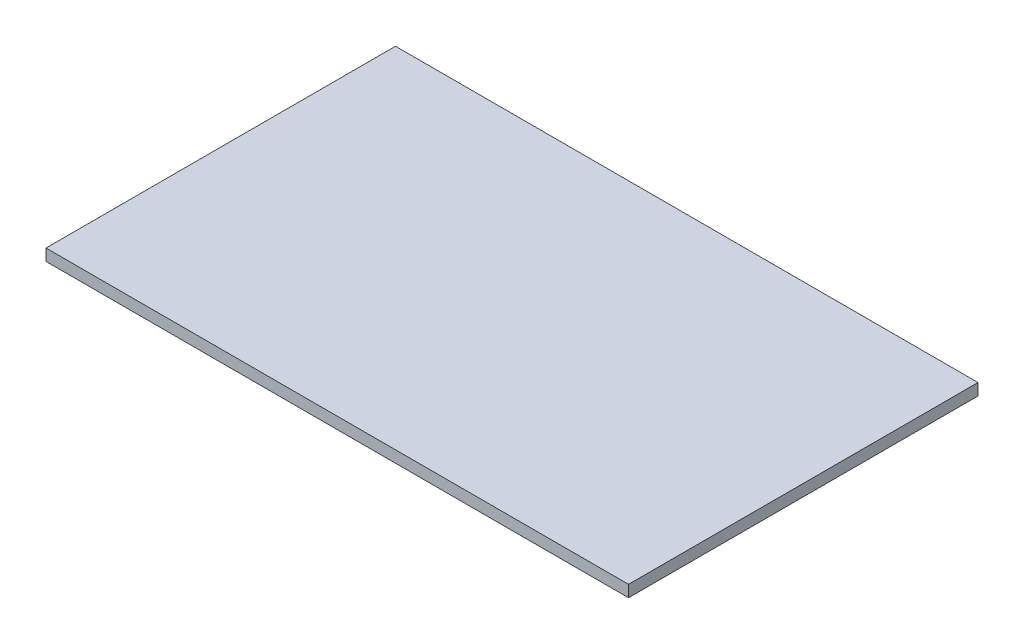
ISO-10303-21;
HEADER;
FILE_DESCRIPTION(('STEP AP214'),'2;1');
FILE_NAME('part.step','',(''),(''),'','','');
FILE_SCHEMA(('AUTOMOTIVE_DESIGN { 1 0 10303 214 1 1 1 1 }'));
ENDSEC;
DATA;
#1=APPLICATION_CONTEXT('core data for automotive mechanical design processes');
#2=APPLICATION_PROTOCOL_DEFINITION('international standard','automotive_design',2000,#1);
#3=PRODUCT_CONTEXT('',#1,'mechanical');
#4=PRODUCT('Part','Part','',(#3));
#5=PRODUCT_RELATED_PRODUCT_CATEGORY('part','',(#4));
#6=PRODUCT_DEFINITION_FORMATION('','',#4);
#7=PRODUCT_DEFINITION_CONTEXT('part definition',#1,'design');
#8=PRODUCT_DEFINITION('design','',#6,#7);
#9=PRODUCT_DEFINITION_SHAPE('','',#8);
#10=(LENGTH_UNIT() NAMED_UNIT(*) SI_UNIT(.MILLI.,.METRE.));
#11=(NAMED_UNIT(*) PLANE_ANGLE_UNIT() SI_UNIT($,.RADIAN.));
#12=(NAMED_UNIT(*) SI_UNIT($,.STERADIAN.) SOLID_ANGLE_UNIT());
#13=UNCERTAINTY_MEASURE_WITH_UNIT(LENGTH_MEASURE(1.E-05),#10,'distance_accuracy_value','');
#14=(GEOMETRIC_REPRESENTATION_CONTEXT(3) GLOBAL_UNCERTAINTY_ASSIGNED_CONTEXT((#13)) GLOBAL_UNIT_ASSIGNED_CONTEXT((#10,
#11,#12)) REPRESENTATION_CONTEXT('',''));
#15=CARTESIAN_POINT('',(0.,0.,0.));
#16=DIRECTION('',(0.,0.,1.));
#17=DIRECTION('',(1.,0.,0.));
#18=AXIS2_PLACEMENT_3D('',#15,#16,#17);
#19=CARTESIAN_POINT('',(0.,10.,0.));
#20=DIRECTION('',(1.,0.,0.));
#21=DIRECTION('',(0.,0.,-1.));
#22=AXIS2_PLACEMENT_3D('',#19,#20,#21);
#23=PLANE('',#22);
#24=DIRECTION('',(0.,0.,1.));
#25=VECTOR('',#24,1.);
#26=CARTESIAN_POINT('',(0.,0.,0.));
#27=LINE('',#26,#25);
#28=CARTESIAN_POINT('',(0.,0.,-300.));
#29=VERTEX_POINT('',#28);
#30=CARTESIAN_POINT('',(0.,0.,0.));
#31=VERTEX_POINT('',#30);
#32=EDGE_CURVE('E96',#29,#31,#27,.T.);
#33=ORIENTED_EDGE('',*,*,#32,.T.);
#34=DIRECTION('',(0.,-1.,0.));
#35=VECTOR('',#34,1.);
#36=CARTESIAN_POINT('',(0.,10.,0.));
#37=LINE('',#36,#35);
#38=CARTESIAN_POINT('',(0.,10.,0.));
#39=VERTEX_POINT('',#38);
#40=EDGE_CURVE('E11',#39,#31,#37,.T.);
#41=ORIENTED_EDGE('',*,*,#40,.F.);
#42=DIRECTION('',(0.,0.,1.));
#43=VECTOR('',#42,1.);
#44=CARTESIAN_POINT('',(0.,10.,0.));
#45=LINE('',#44,#43);
#46=CARTESIAN_POINT('',(0.,10.,-300.));
#47=VERTEX_POINT('',#46);
#48=EDGE_CURVE('E84',#47,#39,#45,.T.);
#49=ORIENTED_EDGE('',*,*,#48,.F.);
#50=DIRECTION('',(0.,-1.,0.));
#51=VECTOR('',#50,1.);
#52=CARTESIAN_POINT('',(0.,10.,-300.));
#53=LINE('',#52,#51);
#54=EDGE_CURVE('E92',#47,#29,#53,.T.);
#55=ORIENTED_EDGE('',*,*,#54,.T.);
#56=EDGE_LOOP('',(#33,#41,#49,#55));
#57=FACE_BOUND('',#56,.T.);
#58=ADVANCED_FACE('F33',(#57),#23,.F.);
#59=CARTESIAN_POINT('',(0.,10.,0.));
#60=DIRECTION('',(0.,0.,-1.));
#61=DIRECTION('',(-1.,0.,0.));
#62=AXIS2_PLACEMENT_3D('',#59,#60,#61);
#63=PLANE('',#62);
#64=DIRECTION('',(1.,0.,0.));
#65=VECTOR('',#64,1.);
#66=CARTESIAN_POINT('',(0.,0.,0.));
#67=LINE('',#66,#65);
#68=CARTESIAN_POINT('',(500.,0.,0.));
#69=VERTEX_POINT('',#68);
#70=EDGE_CURVE('E88',#31,#69,#67,.T.);
#71=ORIENTED_EDGE('',*,*,#70,.T.);
#72=DIRECTION('',(0.,-1.,0.));
#73=VECTOR('',#72,1.);
#74=CARTESIAN_POINT('',(500.,10.,0.));
#75=LINE('',#74,#73);
#76=CARTESIAN_POINT('',(500.,10.,0.));
#77=VERTEX_POINT('',#76);
#78=EDGE_CURVE('E41',#77,#69,#75,.T.);
#79=ORIENTED_EDGE('',*,*,#78,.F.);
#80=DIRECTION('',(1.,0.,0.));
#81=VECTOR('',#80,1.);
#82=CARTESIAN_POINT('',(0.,10.,0.));
#83=LINE('',#82,#81);
#84=EDGE_CURVE('E79',#39,#77,#83,.T.);
#85=ORIENTED_EDGE('',*,*,#84,.F.);
#86=ORIENTED_EDGE('',*,*,#40,.T.);
#87=EDGE_LOOP('',(#71,#79,#85,#86));
#88=FACE_BOUND('',#87,.T.);
#89=ADVANCED_FACE('F87',(#88),#63,.F.);
#90=CARTESIAN_POINT('',(500.,10.,0.));
#91=DIRECTION('',(-1.,0.,0.));
#92=DIRECTION('',(0.,0.,1.));
#93=AXIS2_PLACEMENT_3D('',#90,#91,#92);
#94=PLANE('',#93);
#95=DIRECTION('',(0.,0.,-1.));
#96=VECTOR('',#95,1.);
#97=CARTESIAN_POINT('',(500.,0.,0.));
#98=LINE('',#97,#96);
#99=CARTESIAN_POINT('',(500.,0.,-300.));
#100=VERTEX_POINT('',#99);
#101=EDGE_CURVE('E66',#69,#100,#98,.T.);
#102=ORIENTED_EDGE('',*,*,#101,.T.);
#103=DIRECTION('',(0.,-1.,0.));
#104=VECTOR('',#103,1.);
#105=CARTESIAN_POINT('',(500.,10.,-300.));
#106=LINE('',#105,#104);
#107=CARTESIAN_POINT('',(500.,10.,-300.));
#108=VERTEX_POINT('',#107);
#109=EDGE_CURVE('E89',#108,#100,#106,.T.);
#110=ORIENTED_EDGE('',*,*,#109,.F.);
#111=DIRECTION('',(0.,0.,-1.));
#112=VECTOR('',#111,1.);
#113=CARTESIAN_POINT('',(500.,10.,0.));
#114=LINE('',#113,#112);
#115=EDGE_CURVE('E82',#77,#108,#114,.T.);
#116=ORIENTED_EDGE('',*,*,#115,.F.);
#117=ORIENTED_EDGE('',*,*,#78,.T.);
#118=EDGE_LOOP('',(#102,#110,#116,#117));
#119=FACE_BOUND('',#118,.T.);
#120=ADVANCED_FACE('F90',(#119),#94,.F.);
#121=CARTESIAN_POINT('',(0.,10.,-300.));
#122=DIRECTION('',(0.,0.,1.));
#123=DIRECTION('',(1.,0.,0.));
#124=AXIS2_PLACEMENT_3D('',#121,#122,#123);
#125=PLANE('',#124);
#126=DIRECTION('',(-1.,0.,0.));
#127=VECTOR('',#126,1.);
#128=CARTESIAN_POINT('',(0.,0.,-300.));
#129=LINE('',#128,#127);
#130=EDGE_CURVE('E72',#100,#29,#129,.T.);
#131=ORIENTED_EDGE('',*,*,#130,.T.);
#132=ORIENTED_EDGE('',*,*,#54,.F.);
#133=DIRECTION('',(-1.,0.,0.));
#134=VECTOR('',#133,1.);
#135=CARTESIAN_POINT('',(0.,10.,-300.));
#136=LINE('',#135,#134);
#137=EDGE_CURVE('E49',#108,#47,#136,.T.);
#138=ORIENTED_EDGE('',*,*,#137,.F.);
#139=ORIENTED_EDGE('',*,*,#109,.T.);
#140=EDGE_LOOP('',(#131,#132,#138,#139));
#141=FACE_BOUND('',#140,.T.);
#142=ADVANCED_FACE('F103',(#141),#125,.F.);
#143=CARTESIAN_POINT('',(0.,10.,0.));
#144=DIRECTION('',(0.,-1.,0.));
#145=DIRECTION('',(0.,0.,-1.));
#146=AXIS2_PLACEMENT_3D('',#143,#144,#145);
#147=PLANE('',#146);
#148=ORIENTED_EDGE('',*,*,#48,.T.);
#149=ORIENTED_EDGE('',*,*,#84,.T.);
#150=ORIENTED_EDGE('',*,*,#115,.T.);
#151=ORIENTED_EDGE('',*,*,#137,.T.);
#152=EDGE_LOOP('',(#148,#149,#150,#151));
#153=FACE_BOUND('',#152,.T.);
#154=ADVANCED_FACE('F80',(#153),#147,.F.);
#155=CARTESIAN_POINT('',(0.,0.,0.));
#156=DIRECTION('',(0.,-1.,0.));
#157=DIRECTION('',(0.,0.,-1.));
#158=AXIS2_PLACEMENT_3D('',#155,#156,#157);
#159=PLANE('',#158);
#160=ORIENTED_EDGE('',*,*,#32,.F.);
#161=ORIENTED_EDGE('',*,*,#130,.F.);
#162=ORIENTED_EDGE('',*,*,#101,.F.);
#163=ORIENTED_EDGE('',*,*,#70,.F.);
#164=EDGE_LOOP('',(#160,#161,#162,#163));
#165=FACE_BOUND('',#164,.T.);
#166=ADVANCED_FACE('F106',(#165),#159,.T.);
#167=CLOSED_SHELL('',(#58,#89,#120,#142,#154,#166));
#168=MANIFOLD_SOLID_BREP('B2',#167);
#169=ADVANCED_BREP_SHAPE_REPRESENTATION('',(#18,#168),#14);
#170=SHAPE_DEFINITION_REPRESENTATION(#9,#169);
ENDSEC;
END-ISO-10303-21;
